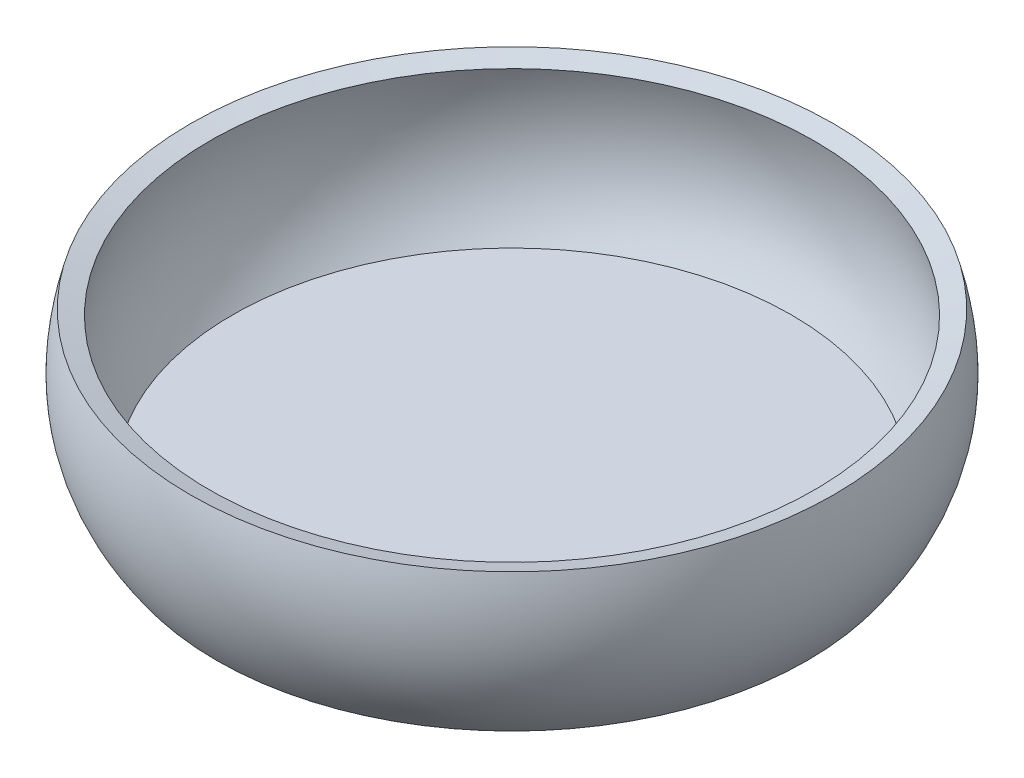
ISO-10303-21;
HEADER;
FILE_DESCRIPTION(('STEP AP214'),'2;1');
FILE_NAME('part.step','',(''),(''),'','','');
FILE_SCHEMA(('AUTOMOTIVE_DESIGN { 1 0 10303 214 1 1 1 1 }'));
ENDSEC;
DATA;
#1=APPLICATION_CONTEXT('core data for automotive mechanical design processes');
#2=APPLICATION_PROTOCOL_DEFINITION('international standard','automotive_design',2000,#1);
#3=PRODUCT_CONTEXT('',#1,'mechanical');
#4=PRODUCT('Part','Part','',(#3));
#5=PRODUCT_RELATED_PRODUCT_CATEGORY('part','',(#4));
#6=PRODUCT_DEFINITION_FORMATION('','',#4);
#7=PRODUCT_DEFINITION_CONTEXT('part definition',#1,'design');
#8=PRODUCT_DEFINITION('design','',#6,#7);
#9=PRODUCT_DEFINITION_SHAPE('','',#8);
#10=(LENGTH_UNIT() NAMED_UNIT(*) SI_UNIT(.MILLI.,.METRE.));
#11=(NAMED_UNIT(*) PLANE_ANGLE_UNIT() SI_UNIT($,.RADIAN.));
#12=(NAMED_UNIT(*) SI_UNIT($,.STERADIAN.) SOLID_ANGLE_UNIT());
#13=UNCERTAINTY_MEASURE_WITH_UNIT(LENGTH_MEASURE(1.E-05),#10,'distance_accuracy_value','');
#14=(GEOMETRIC_REPRESENTATION_CONTEXT(3) GLOBAL_UNCERTAINTY_ASSIGNED_CONTEXT((#13)) GLOBAL_UNIT_ASSIGNED_CONTEXT((#10,
#11,#12)) REPRESENTATION_CONTEXT('',''));
#15=CARTESIAN_POINT('',(0.,0.,0.));
#16=DIRECTION('',(0.,0.,1.));
#17=DIRECTION('',(1.,0.,0.));
#18=AXIS2_PLACEMENT_3D('',#15,#16,#17);
#19=CARTESIAN_POINT('',(0.,25.5500508576249,0.));
#20=DIRECTION('',(0.,1.,0.));
#21=DIRECTION('',(0.,0.,1.));
#22=AXIS2_PLACEMENT_3D('',#19,#20,#21);
#23=CONICAL_SURFACE('',#22,51.1582891362935,1.2986418284861);
#24=CARTESIAN_POINT('',(0.,26.4568345601992,0.));
#25=DIRECTION('',(0.,-1.,0.));
#26=DIRECTION('',(0.,0.,-1.));
#27=AXIS2_PLACEMENT_3D('',#24,#25,#26);
#28=CIRCLE('',#27,54.4074893783838);
#29=CARTESIAN_POINT('',(0.,26.4568345601992,-54.4074893783838));
#30=VERTEX_POINT('',#29);
#31=EDGE_CURVE('E59',#30,#30,#28,.T.);
#32=ORIENTED_EDGE('',*,*,#31,.F.);
#33=EDGE_LOOP('',(#32));
#34=FACE_BOUND('',#33,.T.);
#35=CARTESIAN_POINT('',(0.,25.5500508576249,0.));
#36=DIRECTION('',(0.,-1.,0.));
#37=DIRECTION('',(0.,0.,-1.));
#38=AXIS2_PLACEMENT_3D('',#35,#36,#37);
#39=CIRCLE('',#38,51.1582891362935);
#40=CARTESIAN_POINT('',(0.,25.5500508576249,-51.1582891362935));
#41=VERTEX_POINT('',#40);
#42=EDGE_CURVE('E10',#41,#41,#39,.T.);
#43=ORIENTED_EDGE('',*,*,#42,.T.);
#44=EDGE_LOOP('',(#43));
#45=FACE_BOUND('',#44,.T.);
#46=ADVANCED_FACE('F42',(#34,#45),#23,.F.);
#47=CARTESIAN_POINT('',(47.2834656460014,2.,0.));
#48=CARTESIAN_POINT('',(50.1534426588792,5.91408970178292,0.));
#49=CARTESIAN_POINT('',(52.2213062708687,12.924512734993,0.));
#50=CARTESIAN_POINT('',(52.5699554724857,20.4413623456256,0.));
#51=CARTESIAN_POINT('',(51.1582891362935,25.5500508576249,0.));
#52=B_SPLINE_CURVE_WITH_KNOTS('',2,(#47,#48,#49,#50,#51),.UNSPECIFIED.,.F.,.F.,(3,1,1,3),(0.,
0.375,0.625,1.),.UNSPECIFIED.);
#53=CARTESIAN_POINT('',(0.,0.,0.));
#54=DIRECTION('',(0.,-1.,0.));
#55=AXIS1_PLACEMENT('',#53,#54);
#56=SURFACE_OF_REVOLUTION('',#52,#55);
#57=ORIENTED_EDGE('',*,*,#42,.F.);
#58=EDGE_LOOP('',(#57));
#59=FACE_BOUND('',#58,.T.);
#60=CARTESIAN_POINT('',(0.,2.,0.));
#61=DIRECTION('',(0.,-1.,0.));
#62=DIRECTION('',(0.,0.,-1.));
#63=AXIS2_PLACEMENT_3D('',#60,#61,#62);
#64=CIRCLE('',#63,47.2834656460014);
#65=CARTESIAN_POINT('',(0.,2.,-47.2834656460014));
#66=VERTEX_POINT('',#65);
#67=EDGE_CURVE('E49',#66,#66,#64,.T.);
#68=ORIENTED_EDGE('',*,*,#67,.T.);
#69=EDGE_LOOP('',(#68));
#70=FACE_BOUND('',#69,.T.);
#71=ADVANCED_FACE('F91',(#59,#70),#56,.T.);
#72=CARTESIAN_POINT('',(0.,2.,0.));
#73=DIRECTION('',(0.,1.,0.));
#74=DIRECTION('',(0.,0.,1.));
#75=AXIS2_PLACEMENT_3D('',#72,#73,#74);
#76=PLANE('',#75);
#77=CARTESIAN_POINT('',(25.5964514931168,2.,20.0267738530329));
#78=DIRECTION('',(0.,1.,0.));
#79=DIRECTION('',(0.,0.,1.));
#80=AXIS2_PLACEMENT_3D('',#77,#78,#79);
#81=CIRCLE('',#80,2.50000000000001);
#82=CARTESIAN_POINT('',(25.5964514931168,2.,22.5267738530329));
#83=VERTEX_POINT('',#82);
#84=EDGE_CURVE('E65',#83,#83,#81,.T.);
#85=ORIENTED_EDGE('',*,*,#84,.F.);
#86=EDGE_LOOP('',(#85));
#87=FACE_BOUND('',#86,.T.);
#88=CARTESIAN_POINT('',(17.7206202644655,2.,13.8646895905612));
#89=DIRECTION('',(0.,1.,0.));
#90=DIRECTION('',(0.,0.,1.));
#91=AXIS2_PLACEMENT_3D('',#88,#89,#90);
#92=CIRCLE('',#91,2.5);
#93=CARTESIAN_POINT('',(17.7206202644655,2.,16.3646895905612));
#94=VERTEX_POINT('',#93);
#95=EDGE_CURVE('E172',#94,#94,#92,.T.);
#96=ORIENTED_EDGE('',*,*,#95,.F.);
#97=EDGE_LOOP('',(#96));
#98=FACE_BOUND('',#97,.T.);
#99=ORIENTED_EDGE('',*,*,#67,.F.);
#100=EDGE_LOOP('',(#99));
#101=FACE_BOUND('',#100,.T.);
#102=ADVANCED_FACE('F88',(#87,#98,#101),#76,.T.);
#103=CARTESIAN_POINT('',(0.,0.,0.));
#104=DIRECTION('',(0.,1.,0.));
#105=DIRECTION('',(0.,0.,1.));
#106=AXIS2_PLACEMENT_3D('',#103,#104,#105);
#107=PLANE('',#106);
#108=CARTESIAN_POINT('',(25.5964514931168,0.,20.0267738530329));
#109=DIRECTION('',(0.,-1.,0.));
#110=DIRECTION('',(0.,0.,-1.));
#111=AXIS2_PLACEMENT_3D('',#108,#109,#110);
#112=CIRCLE('',#111,2.50000000000001);
#113=CARTESIAN_POINT('',(25.5964514931168,0.,17.5267738530329));
#114=VERTEX_POINT('',#113);
#115=EDGE_CURVE('E170',#114,#114,#112,.T.);
#116=ORIENTED_EDGE('',*,*,#115,.F.);
#117=EDGE_LOOP('',(#116));
#118=FACE_BOUND('',#117,.T.);
#119=CARTESIAN_POINT('',(17.7206202644655,0.,13.8646895905612));
#120=DIRECTION('',(0.,-1.,0.));
#121=DIRECTION('',(0.,0.,-1.));
#122=AXIS2_PLACEMENT_3D('',#119,#120,#121);
#123=CIRCLE('',#122,2.5);
#124=CARTESIAN_POINT('',(17.7206202644655,0.,11.3646895905612));
#125=VERTEX_POINT('',#124);
#126=EDGE_CURVE('E173',#125,#125,#123,.T.);
#127=ORIENTED_EDGE('',*,*,#126,.F.);
#128=EDGE_LOOP('',(#127));
#129=FACE_BOUND('',#128,.T.);
#130=CARTESIAN_POINT('',(0.,0.,0.));
#131=DIRECTION('',(0.,-1.,0.));
#132=DIRECTION('',(0.,0.,-1.));
#133=AXIS2_PLACEMENT_3D('',#130,#131,#132);
#134=CIRCLE('',#133,50.);
#135=CARTESIAN_POINT('',(0.,0.,-50.));
#136=VERTEX_POINT('',#135);
#137=EDGE_CURVE('E54',#136,#136,#134,.T.);
#138=ORIENTED_EDGE('',*,*,#137,.T.);
#139=EDGE_LOOP('',(#138));
#140=FACE_BOUND('',#139,.T.);
#141=ADVANCED_FACE('F83',(#118,#129,#140),#107,.F.);
#142=CARTESIAN_POINT('',(50.,0.,0.));
#143=CARTESIAN_POINT('',(58.5500298091798,11.6132248521743,0.));
#144=CARTESIAN_POINT('',(54.4074893783838,26.4568345601992,0.));
#145=B_SPLINE_CURVE_WITH_KNOTS('',2,(#142,#143,#144),.UNSPECIFIED.,.F.,.F.,(3,3),(0.,1.),.UNSPECIFIED.);
#146=CARTESIAN_POINT('',(0.,0.,0.));
#147=DIRECTION('',(0.,-1.,0.));
#148=AXIS1_PLACEMENT('',#146,#147);
#149=SURFACE_OF_REVOLUTION('',#145,#148);
#150=ORIENTED_EDGE('',*,*,#31,.T.);
#151=EDGE_LOOP('',(#150));
#152=FACE_BOUND('',#151,.T.);
#153=ORIENTED_EDGE('',*,*,#137,.F.);
#154=EDGE_LOOP('',(#153));
#155=FACE_BOUND('',#154,.T.);
#156=ADVANCED_FACE('F78',(#152,#155),#149,.F.);
#157=CARTESIAN_POINT('',(17.7206202644655,22.,13.8646895905612));
#158=DIRECTION('',(0.,-1.,0.));
#159=DIRECTION('',(0.,0.,-1.));
#160=AXIS2_PLACEMENT_3D('',#157,#158,#159);
#161=CYLINDRICAL_SURFACE('',#160,2.5);
#162=ORIENTED_EDGE('',*,*,#95,.T.);
#163=EDGE_LOOP('',(#162));
#164=FACE_BOUND('',#163,.T.);
#165=ORIENTED_EDGE('',*,*,#126,.T.);
#166=EDGE_LOOP('',(#165));
#167=FACE_BOUND('',#166,.T.);
#168=ADVANCED_FACE('F82',(#164,#167),#161,.F.);
#169=CARTESIAN_POINT('',(25.5964514931168,22.,20.0267738530329));
#170=DIRECTION('',(0.,-1.,0.));
#171=DIRECTION('',(0.,0.,-1.));
#172=AXIS2_PLACEMENT_3D('',#169,#170,#171);
#173=CYLINDRICAL_SURFACE('',#172,2.50000000000001);
#174=ORIENTED_EDGE('',*,*,#84,.T.);
#175=EDGE_LOOP('',(#174));
#176=FACE_BOUND('',#175,.T.);
#177=ORIENTED_EDGE('',*,*,#115,.T.);
#178=EDGE_LOOP('',(#177));
#179=FACE_BOUND('',#178,.T.);
#180=ADVANCED_FACE('F135',(#176,#179),#173,.F.);
#181=CLOSED_SHELL('',(#46,#71,#102,#141,#156,#168,#180));
#182=MANIFOLD_SOLID_BREP('B2',#181);
#183=ADVANCED_BREP_SHAPE_REPRESENTATION('',(#18,#182),#14);
#184=SHAPE_DEFINITION_REPRESENTATION(#9,#183);
ENDSEC;
END-ISO-10303-21;
